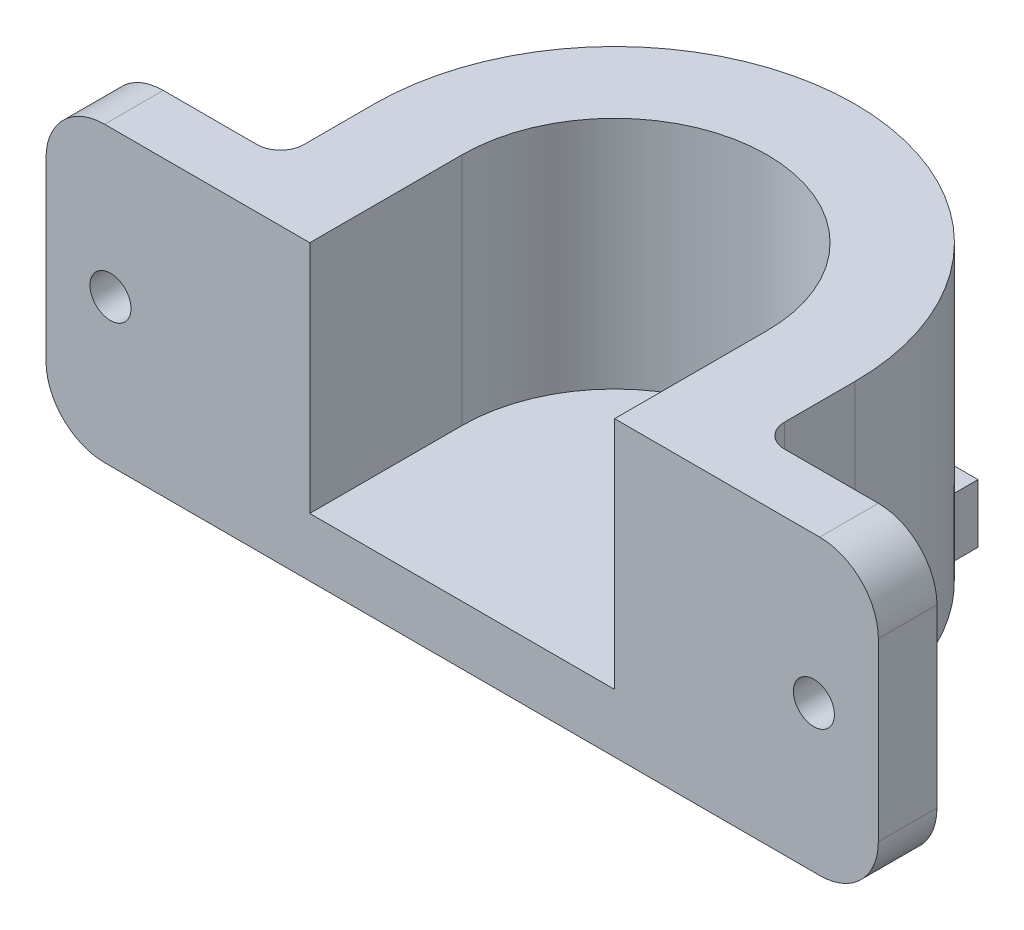
ISO-10303-21;
HEADER;
FILE_DESCRIPTION(('STEP AP214'),'2;1');
FILE_NAME('part.step','',(''),(''),'','','');
FILE_SCHEMA(('AUTOMOTIVE_DESIGN { 1 0 10303 214 1 1 1 1 }'));
ENDSEC;
DATA;
#1=APPLICATION_CONTEXT('core data for automotive mechanical design processes');
#2=APPLICATION_PROTOCOL_DEFINITION('international standard','automotive_design',2000,#1);
#3=PRODUCT_CONTEXT('',#1,'mechanical');
#4=PRODUCT('Part','Part','',(#3));
#5=PRODUCT_RELATED_PRODUCT_CATEGORY('part','',(#4));
#6=PRODUCT_DEFINITION_FORMATION('','',#4);
#7=PRODUCT_DEFINITION_CONTEXT('part definition',#1,'design');
#8=PRODUCT_DEFINITION('design','',#6,#7);
#9=PRODUCT_DEFINITION_SHAPE('','',#8);
#10=(LENGTH_UNIT() NAMED_UNIT(*) SI_UNIT(.MILLI.,.METRE.));
#11=(NAMED_UNIT(*) PLANE_ANGLE_UNIT() SI_UNIT($,.RADIAN.));
#12=(NAMED_UNIT(*) SI_UNIT($,.STERADIAN.) SOLID_ANGLE_UNIT());
#13=UNCERTAINTY_MEASURE_WITH_UNIT(LENGTH_MEASURE(1.E-05),#10,'distance_accuracy_value','');
#14=(GEOMETRIC_REPRESENTATION_CONTEXT(3) GLOBAL_UNCERTAINTY_ASSIGNED_CONTEXT((#13)) GLOBAL_UNIT_ASSIGNED_CONTEXT((#10,
#11,#12)) REPRESENTATION_CONTEXT('',''));
#15=CARTESIAN_POINT('',(0.,0.,0.));
#16=DIRECTION('',(0.,0.,1.));
#17=DIRECTION('',(1.,0.,0.));
#18=AXIS2_PLACEMENT_3D('',#15,#16,#17);
#19=CARTESIAN_POINT('',(0.,25.,13.));
#20=DIRECTION('',(-1.,0.,0.));
#21=DIRECTION('',(0.,0.,1.));
#22=AXIS2_PLACEMENT_3D('',#19,#20,#21);
#23=PLANE('',#22);
#24=DIRECTION('',(0.,-1.,0.));
#25=VECTOR('',#24,1.);
#26=CARTESIAN_POINT('',(0.,25.,13.));
#27=LINE('',#26,#25);
#28=CARTESIAN_POINT('',(0.,25.,13.));
#29=VERTEX_POINT('',#28);
#30=CARTESIAN_POINT('',(0.,5.,13.));
#31=VERTEX_POINT('',#30);
#32=EDGE_CURVE('E294',#29,#31,#27,.T.);
#33=ORIENTED_EDGE('',*,*,#32,.T.);
#34=DIRECTION('',(0.,0.,1.));
#35=VECTOR('',#34,1.);
#36=CARTESIAN_POINT('',(0.,5.,-18.));
#37=LINE('',#36,#35);
#38=CARTESIAN_POINT('',(0.,5.,0.));
#39=VERTEX_POINT('',#38);
#40=EDGE_CURVE('E54',#39,#31,#37,.T.);
#41=ORIENTED_EDGE('',*,*,#40,.F.);
#42=DIRECTION('',(0.,-1.,0.));
#43=VECTOR('',#42,1.);
#44=CARTESIAN_POINT('',(0.,25.,0.));
#45=LINE('',#44,#43);
#46=CARTESIAN_POINT('',(0.,25.,0.));
#47=VERTEX_POINT('',#46);
#48=EDGE_CURVE('E334',#47,#39,#45,.T.);
#49=ORIENTED_EDGE('',*,*,#48,.F.);
#50=DIRECTION('',(0.,0.,-1.));
#51=VECTOR('',#50,1.);
#52=CARTESIAN_POINT('',(0.,25.,13.));
#53=LINE('',#52,#51);
#54=EDGE_CURVE('E269',#29,#47,#53,.T.);
#55=ORIENTED_EDGE('',*,*,#54,.F.);
#56=EDGE_LOOP('',(#33,#41,#49,#55));
#57=FACE_BOUND('',#56,.T.);
#58=ADVANCED_FACE('F39',(#57),#23,.F.);
#59=CARTESIAN_POINT('',(13.,25.,0.));
#60=DIRECTION('',(0.,-1.,0.));
#61=DIRECTION('',(0.,0.,-1.));
#62=AXIS2_PLACEMENT_3D('',#59,#60,#61);
#63=CYLINDRICAL_SURFACE('',#62,13.);
#64=ORIENTED_EDGE('',*,*,#48,.T.);
#65=CARTESIAN_POINT('',(13.,5.,0.));
#66=DIRECTION('',(0.,1.,0.));
#67=DIRECTION('',(-1.,0.,0.));
#68=AXIS2_PLACEMENT_3D('',#65,#66,#67);
#69=CIRCLE('',#68,13.);
#70=CARTESIAN_POINT('',(26.,5.,0.));
#71=VERTEX_POINT('',#70);
#72=EDGE_CURVE('E61',#39,#71,#69,.F.);
#73=ORIENTED_EDGE('',*,*,#72,.T.);
#74=DIRECTION('',(0.,-1.,0.));
#75=VECTOR('',#74,1.);
#76=CARTESIAN_POINT('',(26.,25.,0.));
#77=LINE('',#76,#75);
#78=CARTESIAN_POINT('',(26.,25.,0.));
#79=VERTEX_POINT('',#78);
#80=EDGE_CURVE('E332',#79,#71,#77,.T.);
#81=ORIENTED_EDGE('',*,*,#80,.F.);
#82=CARTESIAN_POINT('',(13.,25.,0.));
#83=DIRECTION('',(0.,-1.,0.));
#84=DIRECTION('',(0.,0.,-1.));
#85=AXIS2_PLACEMENT_3D('',#82,#83,#84);
#86=CIRCLE('',#85,13.);
#87=EDGE_CURVE('E272',#47,#79,#86,.T.);
#88=ORIENTED_EDGE('',*,*,#87,.F.);
#89=EDGE_LOOP('',(#64,#73,#81,#88));
#90=FACE_BOUND('',#89,.T.);
#91=ADVANCED_FACE('F418',(#90),#63,.F.);
#92=CARTESIAN_POINT('',(26.,25.,0.));
#93=DIRECTION('',(1.,0.,0.));
#94=DIRECTION('',(0.,0.,-1.));
#95=AXIS2_PLACEMENT_3D('',#92,#93,#94);
#96=PLANE('',#95);
#97=ORIENTED_EDGE('',*,*,#80,.T.);
#98=DIRECTION('',(0.,0.,1.));
#99=VECTOR('',#98,1.);
#100=CARTESIAN_POINT('',(26.,5.,-18.));
#101=LINE('',#100,#99);
#102=CARTESIAN_POINT('',(26.,5.,13.));
#103=VERTEX_POINT('',#102);
#104=EDGE_CURVE('E243',#71,#103,#101,.T.);
#105=ORIENTED_EDGE('',*,*,#104,.T.);
#106=DIRECTION('',(0.,-1.,0.));
#107=VECTOR('',#106,1.);
#108=CARTESIAN_POINT('',(26.,25.,13.));
#109=LINE('',#108,#107);
#110=CARTESIAN_POINT('',(26.,25.,13.));
#111=VERTEX_POINT('',#110);
#112=EDGE_CURVE('E329',#111,#103,#109,.T.);
#113=ORIENTED_EDGE('',*,*,#112,.F.);
#114=DIRECTION('',(0.,0.,1.));
#115=VECTOR('',#114,1.);
#116=CARTESIAN_POINT('',(26.,25.,0.));
#117=LINE('',#116,#115);
#118=EDGE_CURVE('E275',#79,#111,#117,.T.);
#119=ORIENTED_EDGE('',*,*,#118,.F.);
#120=EDGE_LOOP('',(#97,#105,#113,#119));
#121=FACE_BOUND('',#120,.T.);
#122=ADVANCED_FACE('F424',(#121),#96,.F.);
#123=CARTESIAN_POINT('',(48.5,25.,13.));
#124=DIRECTION('',(-1.,0.,0.));
#125=DIRECTION('',(0.,0.,1.));
#126=AXIS2_PLACEMENT_3D('',#123,#124,#125);
#127=PLANE('',#126);
#128=DIRECTION('',(0.,-1.,0.));
#129=VECTOR('',#128,1.);
#130=CARTESIAN_POINT('',(48.5,25.,7.99999999999999));
#131=LINE('',#130,#129);
#132=CARTESIAN_POINT('',(48.5,20.,7.99999999999999));
#133=VERTEX_POINT('',#132);
#134=CARTESIAN_POINT('',(48.5,5.,7.99999999999999));
#135=VERTEX_POINT('',#134);
#136=EDGE_CURVE('E323',#133,#135,#131,.T.);
#137=ORIENTED_EDGE('',*,*,#136,.F.);
#138=DIRECTION('',(0.,0.,-1.));
#139=VECTOR('',#138,1.);
#140=CARTESIAN_POINT('',(48.5,20.,13.));
#141=LINE('',#140,#139);
#142=CARTESIAN_POINT('',(48.5,20.,13.));
#143=VERTEX_POINT('',#142);
#144=EDGE_CURVE('E349',#133,#143,#141,.F.);
#145=ORIENTED_EDGE('',*,*,#144,.T.);
#146=DIRECTION('',(0.,-1.,0.));
#147=VECTOR('',#146,1.);
#148=CARTESIAN_POINT('',(48.5,25.,13.));
#149=LINE('',#148,#147);
#150=CARTESIAN_POINT('',(48.5,5.,13.));
#151=VERTEX_POINT('',#150);
#152=EDGE_CURVE('E326',#143,#151,#149,.T.);
#153=ORIENTED_EDGE('',*,*,#152,.T.);
#154=DIRECTION('',(0.,0.,-1.));
#155=VECTOR('',#154,1.);
#156=CARTESIAN_POINT('',(48.5,5.,7.99999999999999));
#157=LINE('',#156,#155);
#158=EDGE_CURVE('E346',#151,#135,#157,.T.);
#159=ORIENTED_EDGE('',*,*,#158,.T.);
#160=EDGE_LOOP('',(#137,#145,#153,#159));
#161=FACE_BOUND('',#160,.T.);
#162=ADVANCED_FACE('F501',(#161),#127,.F.);
#163=CARTESIAN_POINT('',(48.5,25.,7.99999999999999));
#164=DIRECTION('',(0.,0.,1.));
#165=DIRECTION('',(1.,0.,0.));
#166=AXIS2_PLACEMENT_3D('',#163,#164,#165);
#167=PLANE('',#166);
#168=CARTESIAN_POINT('',(43.,12.5,7.99999999999999));
#169=DIRECTION('',(0.,0.,-1.));
#170=DIRECTION('',(-1.,0.,0.));
#171=AXIS2_PLACEMENT_3D('',#168,#169,#170);
#172=CIRCLE('',#171,1.75);
#173=CARTESIAN_POINT('',(41.25,12.5,7.99999999999999));
#174=VERTEX_POINT('',#173);
#175=EDGE_CURVE('E261',#174,#174,#172,.T.);
#176=ORIENTED_EDGE('',*,*,#175,.F.);
#177=EDGE_LOOP('',(#176));
#178=FACE_BOUND('',#177,.T.);
#179=DIRECTION('',(-1.,0.,0.));
#180=VECTOR('',#179,1.);
#181=CARTESIAN_POINT('',(48.5,0.,7.99999999999999));
#182=LINE('',#181,#180);
#183=CARTESIAN_POINT('',(43.5,0.,7.99999999999999));
#184=VERTEX_POINT('',#183);
#185=CARTESIAN_POINT('',(35.5,0.,7.99999999999999));
#186=VERTEX_POINT('',#185);
#187=EDGE_CURVE('E297',#184,#186,#182,.T.);
#188=ORIENTED_EDGE('',*,*,#187,.T.);
#189=DIRECTION('',(0.,-1.,0.));
#190=VECTOR('',#189,1.);
#191=CARTESIAN_POINT('',(35.5,25.,7.99999999999999));
#192=LINE('',#191,#190);
#193=CARTESIAN_POINT('',(35.5,25.,7.99999999999999));
#194=VERTEX_POINT('',#193);
#195=EDGE_CURVE('E378',#186,#194,#192,.F.);
#196=ORIENTED_EDGE('',*,*,#195,.T.);
#197=DIRECTION('',(-1.,0.,0.));
#198=VECTOR('',#197,1.);
#199=CARTESIAN_POINT('',(48.5,25.,7.99999999999999));
#200=LINE('',#199,#198);
#201=CARTESIAN_POINT('',(43.5,25.,7.99999999999999));
#202=VERTEX_POINT('',#201);
#203=EDGE_CURVE('E280',#202,#194,#200,.T.);
#204=ORIENTED_EDGE('',*,*,#203,.F.);
#205=CARTESIAN_POINT('',(43.5,20.,7.99999999999999));
#206=DIRECTION('',(0.,0.,1.));
#207=DIRECTION('',(1.,0.,0.));
#208=AXIS2_PLACEMENT_3D('',#205,#206,#207);
#209=CIRCLE('',#208,5.);
#210=EDGE_CURVE('E344',#202,#133,#209,.F.);
#211=ORIENTED_EDGE('',*,*,#210,.T.);
#212=ORIENTED_EDGE('',*,*,#136,.T.);
#213=CARTESIAN_POINT('',(43.5,5.,7.99999999999999));
#214=DIRECTION('',(0.,0.,1.));
#215=DIRECTION('',(1.,0.,0.));
#216=AXIS2_PLACEMENT_3D('',#213,#214,#215);
#217=CIRCLE('',#216,5.);
#218=EDGE_CURVE('E342',#135,#184,#217,.F.);
#219=ORIENTED_EDGE('',*,*,#218,.T.);
#220=EDGE_LOOP('',(#188,#196,#204,#211,#212,#219));
#221=FACE_BOUND('',#220,.T.);
#222=ADVANCED_FACE('F499',(#178,#221),#167,.F.);
#223=CARTESIAN_POINT('',(33.5,25.,7.99999999999999));
#224=DIRECTION('',(-1.,0.,0.));
#225=DIRECTION('',(0.,0.,1.));
#226=AXIS2_PLACEMENT_3D('',#223,#224,#225);
#227=PLANE('',#226);
#228=DIRECTION('',(0.,0.,-1.));
#229=VECTOR('',#228,1.);
#230=CARTESIAN_POINT('',(33.5,25.,7.99999999999999));
#231=LINE('',#230,#229);
#232=CARTESIAN_POINT('',(33.5,25.,5.99999999999999));
#233=VERTEX_POINT('',#232);
#234=CARTESIAN_POINT('',(33.5,25.,0.));
#235=VERTEX_POINT('',#234);
#236=EDGE_CURVE('E283',#233,#235,#231,.T.);
#237=ORIENTED_EDGE('',*,*,#236,.F.);
#238=DIRECTION('',(0.,-1.,0.));
#239=VECTOR('',#238,1.);
#240=CARTESIAN_POINT('',(33.5,0.,5.99999999999999));
#241=LINE('',#240,#239);
#242=CARTESIAN_POINT('',(33.5,0.,5.99999999999999));
#243=VERTEX_POINT('',#242);
#244=EDGE_CURVE('E375',#233,#243,#241,.T.);
#245=ORIENTED_EDGE('',*,*,#244,.T.);
#246=DIRECTION('',(0.,0.,-1.));
#247=VECTOR('',#246,1.);
#248=CARTESIAN_POINT('',(33.5,0.,7.99999999999999));
#249=LINE('',#248,#247);
#250=CARTESIAN_POINT('',(33.5,0.,0.));
#251=VERTEX_POINT('',#250);
#252=EDGE_CURVE('E300',#243,#251,#249,.T.);
#253=ORIENTED_EDGE('',*,*,#252,.T.);
#254=DIRECTION('',(0.,-1.,0.));
#255=VECTOR('',#254,1.);
#256=CARTESIAN_POINT('',(33.5,25.,0.));
#257=LINE('',#256,#255);
#258=EDGE_CURVE('E320',#235,#251,#257,.T.);
#259=ORIENTED_EDGE('',*,*,#258,.F.);
#260=EDGE_LOOP('',(#237,#245,#253,#259));
#261=FACE_BOUND('',#260,.T.);
#262=ADVANCED_FACE('F459',(#261),#227,.F.);
#263=CARTESIAN_POINT('',(13.,25.,0.));
#264=DIRECTION('',(0.,-1.,0.));
#265=DIRECTION('',(0.,0.,-1.));
#266=AXIS2_PLACEMENT_3D('',#263,#264,#265);
#267=CYLINDRICAL_SURFACE('',#266,20.5);
#268=CARTESIAN_POINT('',(13.,0.,0.));
#269=DIRECTION('',(0.,1.,0.));
#270=DIRECTION('',(0.,0.,-1.));
#271=AXIS2_PLACEMENT_3D('',#268,#269,#270);
#272=CIRCLE('',#271,20.5);
#273=CARTESIAN_POINT('',(26.,0.,-15.8508674841474));
#274=VERTEX_POINT('',#273);
#275=EDGE_CURVE('E302',#251,#274,#272,.T.);
#276=ORIENTED_EDGE('',*,*,#275,.T.);
#277=DIRECTION('',(0.,-1.,0.));
#278=VECTOR('',#277,1.);
#279=CARTESIAN_POINT('',(26.,25.,-15.8508674841474));
#280=LINE('',#279,#278);
#281=CARTESIAN_POINT('',(26.,5.,-15.8508674841474));
#282=VERTEX_POINT('',#281);
#283=EDGE_CURVE('E250',#274,#282,#280,.F.);
#284=ORIENTED_EDGE('',*,*,#283,.T.);
#285=CARTESIAN_POINT('',(13.,5.,0.));
#286=DIRECTION('',(0.,1.,0.));
#287=DIRECTION('',(-1.,0.,0.));
#288=AXIS2_PLACEMENT_3D('',#285,#286,#287);
#289=CIRCLE('',#288,20.5);
#290=CARTESIAN_POINT('',(22.8107084351743,5.,-18.));
#291=VERTEX_POINT('',#290);
#292=EDGE_CURVE('E11',#282,#291,#289,.T.);
#293=ORIENTED_EDGE('',*,*,#292,.T.);
#294=DIRECTION('',(0.,-1.,0.));
#295=VECTOR('',#294,1.);
#296=CARTESIAN_POINT('',(22.8107084351743,25.,-18.));
#297=LINE('',#296,#295);
#298=CARTESIAN_POINT('',(22.8107084351743,0.,-18.));
#299=VERTEX_POINT('',#298);
#300=EDGE_CURVE('E247',#291,#299,#297,.T.);
#301=ORIENTED_EDGE('',*,*,#300,.T.);
#302=CARTESIAN_POINT('',(3.18929156482572,0.,-18.));
#303=VERTEX_POINT('',#302);
#304=EDGE_CURVE('E306',#299,#303,#272,.T.);
#305=ORIENTED_EDGE('',*,*,#304,.T.);
#306=DIRECTION('',(0.,-1.,0.));
#307=VECTOR('',#306,1.);
#308=CARTESIAN_POINT('',(3.18929156482572,25.,-18.));
#309=LINE('',#308,#307);
#310=CARTESIAN_POINT('',(3.18929156482572,5.,-18.));
#311=VERTEX_POINT('',#310);
#312=EDGE_CURVE('E221',#303,#311,#309,.F.);
#313=ORIENTED_EDGE('',*,*,#312,.T.);
#314=CARTESIAN_POINT('',(0.,5.,-15.8508674841474));
#315=VERTEX_POINT('',#314);
#316=EDGE_CURVE('E43',#311,#315,#289,.T.);
#317=ORIENTED_EDGE('',*,*,#316,.T.);
#318=DIRECTION('',(0.,-1.,0.));
#319=VECTOR('',#318,1.);
#320=CARTESIAN_POINT('',(0.,25.,-15.8508674841474));
#321=LINE('',#320,#319);
#322=CARTESIAN_POINT('',(0.,0.,-15.8508674841474));
#323=VERTEX_POINT('',#322);
#324=EDGE_CURVE('E253',#315,#323,#321,.T.);
#325=ORIENTED_EDGE('',*,*,#324,.T.);
#326=CARTESIAN_POINT('',(-7.5,0.,0.));
#327=VERTEX_POINT('',#326);
#328=EDGE_CURVE('E209',#323,#327,#272,.T.);
#329=ORIENTED_EDGE('',*,*,#328,.T.);
#330=DIRECTION('',(0.,-1.,0.));
#331=VECTOR('',#330,1.);
#332=CARTESIAN_POINT('',(-7.5,25.,0.));
#333=LINE('',#332,#331);
#334=CARTESIAN_POINT('',(-7.5,25.,0.));
#335=VERTEX_POINT('',#334);
#336=EDGE_CURVE('E317',#335,#327,#333,.T.);
#337=ORIENTED_EDGE('',*,*,#336,.F.);
#338=CARTESIAN_POINT('',(13.,25.,0.));
#339=DIRECTION('',(0.,1.,0.));
#340=DIRECTION('',(0.,0.,-1.));
#341=AXIS2_PLACEMENT_3D('',#338,#339,#340);
#342=CIRCLE('',#341,20.5);
#343=EDGE_CURVE('E285',#235,#335,#342,.T.);
#344=ORIENTED_EDGE('',*,*,#343,.F.);
#345=ORIENTED_EDGE('',*,*,#258,.T.);
#346=EDGE_LOOP('',(#276,#284,#293,#301,#305,#313,#317,#325,#329,#337,#344,#345));
#347=FACE_BOUND('',#346,.T.);
#348=ADVANCED_FACE('F397',(#347),#267,.T.);
#349=CARTESIAN_POINT('',(-7.5,25.,0.));
#350=DIRECTION('',(1.,0.,0.));
#351=DIRECTION('',(0.,0.,-1.));
#352=AXIS2_PLACEMENT_3D('',#349,#350,#351);
#353=PLANE('',#352);
#354=DIRECTION('',(0.,0.,1.));
#355=VECTOR('',#354,1.);
#356=CARTESIAN_POINT('',(-7.5,0.,0.));
#357=LINE('',#356,#355);
#358=CARTESIAN_POINT('',(-7.5,0.,6.));
#359=VERTEX_POINT('',#358);
#360=EDGE_CURVE('E305',#327,#359,#357,.T.);
#361=ORIENTED_EDGE('',*,*,#360,.T.);
#362=DIRECTION('',(0.,-1.,0.));
#363=VECTOR('',#362,1.);
#364=CARTESIAN_POINT('',(-7.5,25.,6.));
#365=LINE('',#364,#363);
#366=CARTESIAN_POINT('',(-7.5,25.,6.));
#367=VERTEX_POINT('',#366);
#368=EDGE_CURVE('E383',#359,#367,#365,.F.);
#369=ORIENTED_EDGE('',*,*,#368,.T.);
#370=DIRECTION('',(0.,0.,1.));
#371=VECTOR('',#370,1.);
#372=CARTESIAN_POINT('',(-7.5,25.,0.));
#373=LINE('',#372,#371);
#374=EDGE_CURVE('E287',#335,#367,#373,.T.);
#375=ORIENTED_EDGE('',*,*,#374,.F.);
#376=ORIENTED_EDGE('',*,*,#336,.T.);
#377=EDGE_LOOP('',(#361,#369,#375,#376));
#378=FACE_BOUND('',#377,.T.);
#379=ADVANCED_FACE('F511',(#378),#353,.F.);
#380=CARTESIAN_POINT('',(-7.5,25.,8.));
#381=DIRECTION('',(0.,0.,1.));
#382=DIRECTION('',(1.,0.,0.));
#383=AXIS2_PLACEMENT_3D('',#380,#381,#382);
#384=PLANE('',#383);
#385=CARTESIAN_POINT('',(-17.,12.5,8.));
#386=DIRECTION('',(0.,0.,-1.));
#387=DIRECTION('',(1.,0.,0.));
#388=AXIS2_PLACEMENT_3D('',#385,#386,#387);
#389=CIRCLE('',#388,1.75);
#390=CARTESIAN_POINT('',(-15.25,12.5,8.));
#391=VERTEX_POINT('',#390);
#392=EDGE_CURVE('E264',#391,#391,#389,.T.);
#393=ORIENTED_EDGE('',*,*,#392,.F.);
#394=EDGE_LOOP('',(#393));
#395=FACE_BOUND('',#394,.T.);
#396=DIRECTION('',(-1.,0.,0.));
#397=VECTOR('',#396,1.);
#398=CARTESIAN_POINT('',(-7.5,25.,8.));
#399=LINE('',#398,#397);
#400=CARTESIAN_POINT('',(-9.5,25.,8.));
#401=VERTEX_POINT('',#400);
#402=CARTESIAN_POINT('',(-17.5,25.,8.));
#403=VERTEX_POINT('',#402);
#404=EDGE_CURVE('E290',#401,#403,#399,.T.);
#405=ORIENTED_EDGE('',*,*,#404,.F.);
#406=DIRECTION('',(0.,-1.,0.));
#407=VECTOR('',#406,1.);
#408=CARTESIAN_POINT('',(-9.5,0.,8.));
#409=LINE('',#408,#407);
#410=CARTESIAN_POINT('',(-9.5,0.,8.));
#411=VERTEX_POINT('',#410);
#412=EDGE_CURVE('E380',#401,#411,#409,.T.);
#413=ORIENTED_EDGE('',*,*,#412,.T.);
#414=DIRECTION('',(-1.,0.,0.));
#415=VECTOR('',#414,1.);
#416=CARTESIAN_POINT('',(-7.5,0.,8.));
#417=LINE('',#416,#415);
#418=CARTESIAN_POINT('',(-17.5,0.,8.));
#419=VERTEX_POINT('',#418);
#420=EDGE_CURVE('E273',#411,#419,#417,.T.);
#421=ORIENTED_EDGE('',*,*,#420,.T.);
#422=CARTESIAN_POINT('',(-17.5,5.,8.));
#423=DIRECTION('',(0.,0.,1.));
#424=DIRECTION('',(1.,0.,0.));
#425=AXIS2_PLACEMENT_3D('',#422,#423,#424);
#426=CIRCLE('',#425,5.);
#427=CARTESIAN_POINT('',(-22.5,5.,8.));
#428=VERTEX_POINT('',#427);
#429=EDGE_CURVE('E370',#419,#428,#426,.F.);
#430=ORIENTED_EDGE('',*,*,#429,.T.);
#431=DIRECTION('',(0.,-1.,0.));
#432=VECTOR('',#431,1.);
#433=CARTESIAN_POINT('',(-22.5,25.,8.));
#434=LINE('',#433,#432);
#435=CARTESIAN_POINT('',(-22.5,20.,8.));
#436=VERTEX_POINT('',#435);
#437=EDGE_CURVE('E314',#436,#428,#434,.T.);
#438=ORIENTED_EDGE('',*,*,#437,.F.);
#439=CARTESIAN_POINT('',(-17.5,20.,8.));
#440=DIRECTION('',(0.,0.,1.));
#441=DIRECTION('',(1.,0.,0.));
#442=AXIS2_PLACEMENT_3D('',#439,#440,#441);
#443=CIRCLE('',#442,5.);
#444=EDGE_CURVE('E372',#436,#403,#443,.F.);
#445=ORIENTED_EDGE('',*,*,#444,.T.);
#446=EDGE_LOOP('',(#405,#413,#421,#430,#438,#445));
#447=FACE_BOUND('',#446,.T.);
#448=ADVANCED_FACE('F470',(#395,#447),#384,.F.);
#449=CARTESIAN_POINT('',(-22.5,25.,8.));
#450=DIRECTION('',(1.,0.,0.));
#451=DIRECTION('',(0.,0.,-1.));
#452=AXIS2_PLACEMENT_3D('',#449,#450,#451);
#453=PLANE('',#452);
#454=DIRECTION('',(0.,-1.,0.));
#455=VECTOR('',#454,1.);
#456=CARTESIAN_POINT('',(-22.5,25.,13.));
#457=LINE('',#456,#455);
#458=CARTESIAN_POINT('',(-22.5,20.,13.));
#459=VERTEX_POINT('',#458);
#460=CARTESIAN_POINT('',(-22.5,5.,13.));
#461=VERTEX_POINT('',#460);
#462=EDGE_CURVE('E311',#459,#461,#457,.T.);
#463=ORIENTED_EDGE('',*,*,#462,.F.);
#464=DIRECTION('',(0.,0.,1.));
#465=VECTOR('',#464,1.);
#466=CARTESIAN_POINT('',(-22.5,20.,8.));
#467=LINE('',#466,#465);
#468=EDGE_CURVE('E368',#459,#436,#467,.F.);
#469=ORIENTED_EDGE('',*,*,#468,.T.);
#470=ORIENTED_EDGE('',*,*,#437,.T.);
#471=DIRECTION('',(0.,0.,1.));
#472=VECTOR('',#471,1.);
#473=CARTESIAN_POINT('',(-22.5,5.,13.));
#474=LINE('',#473,#472);
#475=EDGE_CURVE('E365',#428,#461,#474,.T.);
#476=ORIENTED_EDGE('',*,*,#475,.T.);
#477=EDGE_LOOP('',(#463,#469,#470,#476));
#478=FACE_BOUND('',#477,.T.);
#479=ADVANCED_FACE('F478',(#478),#453,.F.);
#480=CARTESIAN_POINT('',(-22.5,25.,13.));
#481=DIRECTION('',(0.,0.,-1.));
#482=DIRECTION('',(-1.,0.,0.));
#483=AXIS2_PLACEMENT_3D('',#480,#481,#482);
#484=PLANE('',#483);
#485=CARTESIAN_POINT('',(-17.,12.5,13.));
#486=DIRECTION('',(0.,0.,-1.));
#487=DIRECTION('',(1.,0.,0.));
#488=AXIS2_PLACEMENT_3D('',#485,#486,#487);
#489=CIRCLE('',#488,1.75);
#490=CARTESIAN_POINT('',(-15.25,12.5,13.));
#491=VERTEX_POINT('',#490);
#492=EDGE_CURVE('E256',#491,#491,#489,.T.);
#493=ORIENTED_EDGE('',*,*,#492,.T.);
#494=EDGE_LOOP('',(#493));
#495=FACE_BOUND('',#494,.T.);
#496=DIRECTION('',(1.,0.,0.));
#497=VECTOR('',#496,1.);
#498=CARTESIAN_POINT('',(-22.5,25.,13.));
#499=LINE('',#498,#497);
#500=CARTESIAN_POINT('',(-17.5,25.,13.));
#501=VERTEX_POINT('',#500);
#502=EDGE_CURVE('E292',#501,#29,#499,.T.);
#503=ORIENTED_EDGE('',*,*,#502,.F.);
#504=CARTESIAN_POINT('',(-17.5,20.,13.));
#505=DIRECTION('',(0.,0.,-1.));
#506=DIRECTION('',(-1.,0.,0.));
#507=AXIS2_PLACEMENT_3D('',#504,#505,#506);
#508=CIRCLE('',#507,5.);
#509=EDGE_CURVE('E363',#501,#459,#508,.F.);
#510=ORIENTED_EDGE('',*,*,#509,.T.);
#511=ORIENTED_EDGE('',*,*,#462,.T.);
#512=CARTESIAN_POINT('',(-17.5,5.,13.));
#513=DIRECTION('',(0.,0.,-1.));
#514=DIRECTION('',(-1.,0.,0.));
#515=AXIS2_PLACEMENT_3D('',#512,#513,#514);
#516=CIRCLE('',#515,5.);
#517=CARTESIAN_POINT('',(-17.5,0.,13.));
#518=VERTEX_POINT('',#517);
#519=EDGE_CURVE('E360',#461,#518,#516,.F.);
#520=ORIENTED_EDGE('',*,*,#519,.T.);
#521=DIRECTION('',(1.,0.,0.));
#522=VECTOR('',#521,1.);
#523=CARTESIAN_POINT('',(26.,0.,13.));
#524=LINE('',#523,#522);
#525=CARTESIAN_POINT('',(43.5,0.,13.));
#526=VERTEX_POINT('',#525);
#527=EDGE_CURVE('E260',#518,#526,#524,.T.);
#528=ORIENTED_EDGE('',*,*,#527,.T.);
#529=CARTESIAN_POINT('',(43.5,5.,13.));
#530=DIRECTION('',(0.,0.,-1.));
#531=DIRECTION('',(-1.,0.,0.));
#532=AXIS2_PLACEMENT_3D('',#529,#530,#531);
#533=CIRCLE('',#532,5.);
#534=EDGE_CURVE('E351',#526,#151,#533,.F.);
#535=ORIENTED_EDGE('',*,*,#534,.T.);
#536=ORIENTED_EDGE('',*,*,#152,.F.);
#537=CARTESIAN_POINT('',(43.5,20.,13.));
#538=DIRECTION('',(0.,0.,-1.));
#539=DIRECTION('',(-1.,0.,0.));
#540=AXIS2_PLACEMENT_3D('',#537,#538,#539);
#541=CIRCLE('',#540,5.);
#542=CARTESIAN_POINT('',(43.5,25.,13.));
#543=VERTEX_POINT('',#542);
#544=EDGE_CURVE('E353',#143,#543,#541,.F.);
#545=ORIENTED_EDGE('',*,*,#544,.T.);
#546=DIRECTION('',(1.,0.,0.));
#547=VECTOR('',#546,1.);
#548=CARTESIAN_POINT('',(26.,25.,13.));
#549=LINE('',#548,#547);
#550=EDGE_CURVE('E277',#111,#543,#549,.T.);
#551=ORIENTED_EDGE('',*,*,#550,.F.);
#552=ORIENTED_EDGE('',*,*,#112,.T.);
#553=DIRECTION('',(-1.,0.,0.));
#554=VECTOR('',#553,1.);
#555=CARTESIAN_POINT('',(0.,5.,13.));
#556=LINE('',#555,#554);
#557=EDGE_CURVE('E229',#103,#31,#556,.T.);
#558=ORIENTED_EDGE('',*,*,#557,.T.);
#559=ORIENTED_EDGE('',*,*,#32,.F.);
#560=EDGE_LOOP('',(#503,#510,#511,#520,#528,#535,#536,#545,#551,#552,#558,#559));
#561=FACE_BOUND('',#560,.T.);
#562=CARTESIAN_POINT('',(43.,12.5,13.));
#563=DIRECTION('',(0.,0.,-1.));
#564=DIRECTION('',(-1.,0.,0.));
#565=AXIS2_PLACEMENT_3D('',#562,#563,#564);
#566=CIRCLE('',#565,1.75);
#567=CARTESIAN_POINT('',(41.25,12.5,13.));
#568=VERTEX_POINT('',#567);
#569=EDGE_CURVE('E257',#568,#568,#566,.T.);
#570=ORIENTED_EDGE('',*,*,#569,.T.);
#571=EDGE_LOOP('',(#570));
#572=FACE_BOUND('',#571,.T.);
#573=ADVANCED_FACE('F484',(#495,#561,#572),#484,.F.);
#574=CARTESIAN_POINT('',(13.,25.,0.));
#575=DIRECTION('',(0.,-1.,0.));
#576=DIRECTION('',(0.,0.,-1.));
#577=AXIS2_PLACEMENT_3D('',#574,#575,#576);
#578=PLANE('',#577);
#579=ORIENTED_EDGE('',*,*,#550,.T.);
#580=DIRECTION('',(0.,0.,-1.));
#581=VECTOR('',#580,1.);
#582=CARTESIAN_POINT('',(43.5,25.,0.));
#583=LINE('',#582,#581);
#584=EDGE_CURVE('E339',#543,#202,#583,.T.);
#585=ORIENTED_EDGE('',*,*,#584,.T.);
#586=ORIENTED_EDGE('',*,*,#203,.T.);
#587=CARTESIAN_POINT('',(35.5,25.,5.99999999999999));
#588=DIRECTION('',(0.,-1.,0.));
#589=DIRECTION('',(0.,0.,-1.));
#590=AXIS2_PLACEMENT_3D('',#587,#588,#589);
#591=CIRCLE('',#590,2.);
#592=EDGE_CURVE('E387',#194,#233,#591,.T.);
#593=ORIENTED_EDGE('',*,*,#592,.T.);
#594=ORIENTED_EDGE('',*,*,#236,.T.);
#595=ORIENTED_EDGE('',*,*,#343,.T.);
#596=ORIENTED_EDGE('',*,*,#374,.T.);
#597=CARTESIAN_POINT('',(-9.5,25.,6.));
#598=DIRECTION('',(0.,-1.,0.));
#599=DIRECTION('',(0.,0.,-1.));
#600=AXIS2_PLACEMENT_3D('',#597,#598,#599);
#601=CIRCLE('',#600,2.);
#602=EDGE_CURVE('E390',#367,#401,#601,.T.);
#603=ORIENTED_EDGE('',*,*,#602,.T.);
#604=ORIENTED_EDGE('',*,*,#404,.T.);
#605=DIRECTION('',(0.,0.,1.));
#606=VECTOR('',#605,1.);
#607=CARTESIAN_POINT('',(-17.5,25.,0.));
#608=LINE('',#607,#606);
#609=EDGE_CURVE('E336',#403,#501,#608,.T.);
#610=ORIENTED_EDGE('',*,*,#609,.T.);
#611=ORIENTED_EDGE('',*,*,#502,.T.);
#612=ORIENTED_EDGE('',*,*,#54,.T.);
#613=ORIENTED_EDGE('',*,*,#87,.T.);
#614=ORIENTED_EDGE('',*,*,#118,.T.);
#615=EDGE_LOOP('',(#579,#585,#586,#593,#594,#595,#596,#603,#604,#610,#611,#612,#613,#614));
#616=FACE_BOUND('',#615,.T.);
#617=ADVANCED_FACE('F455',(#616),#578,.F.);
#618=CARTESIAN_POINT('',(13.,0.,0.));
#619=DIRECTION('',(0.,-1.,0.));
#620=DIRECTION('',(0.,0.,-1.));
#621=AXIS2_PLACEMENT_3D('',#618,#619,#620);
#622=PLANE('',#621);
#623=ORIENTED_EDGE('',*,*,#304,.F.);
#624=DIRECTION('',(1.,0.,0.));
#625=VECTOR('',#624,1.);
#626=CARTESIAN_POINT('',(0.,0.,-18.));
#627=LINE('',#626,#625);
#628=CARTESIAN_POINT('',(26.,0.,-18.));
#629=VERTEX_POINT('',#628);
#630=EDGE_CURVE('E223',#299,#629,#627,.T.);
#631=ORIENTED_EDGE('',*,*,#630,.T.);
#632=DIRECTION('',(0.,0.,1.));
#633=VECTOR('',#632,1.);
#634=CARTESIAN_POINT('',(26.,0.,-18.));
#635=LINE('',#634,#633);
#636=EDGE_CURVE('E213',#629,#274,#635,.T.);
#637=ORIENTED_EDGE('',*,*,#636,.T.);
#638=ORIENTED_EDGE('',*,*,#275,.F.);
#639=ORIENTED_EDGE('',*,*,#252,.F.);
#640=CARTESIAN_POINT('',(35.5,0.,5.99999999999999));
#641=DIRECTION('',(0.,-1.,0.));
#642=DIRECTION('',(0.,0.,-1.));
#643=AXIS2_PLACEMENT_3D('',#640,#641,#642);
#644=CIRCLE('',#643,2.);
#645=EDGE_CURVE('E385',#243,#186,#644,.F.);
#646=ORIENTED_EDGE('',*,*,#645,.T.);
#647=ORIENTED_EDGE('',*,*,#187,.F.);
#648=DIRECTION('',(0.,0.,-1.));
#649=VECTOR('',#648,1.);
#650=CARTESIAN_POINT('',(43.5,0.,13.));
#651=LINE('',#650,#649);
#652=EDGE_CURVE('E358',#184,#526,#651,.F.);
#653=ORIENTED_EDGE('',*,*,#652,.T.);
#654=ORIENTED_EDGE('',*,*,#527,.F.);
#655=DIRECTION('',(0.,0.,1.));
#656=VECTOR('',#655,1.);
#657=CARTESIAN_POINT('',(-17.5,0.,8.));
#658=LINE('',#657,#656);
#659=EDGE_CURVE('E355',#518,#419,#658,.F.);
#660=ORIENTED_EDGE('',*,*,#659,.T.);
#661=ORIENTED_EDGE('',*,*,#420,.F.);
#662=CARTESIAN_POINT('',(-9.5,0.,6.));
#663=DIRECTION('',(0.,-1.,0.));
#664=DIRECTION('',(0.,0.,-1.));
#665=AXIS2_PLACEMENT_3D('',#662,#663,#664);
#666=CIRCLE('',#665,2.);
#667=EDGE_CURVE('E389',#411,#359,#666,.F.);
#668=ORIENTED_EDGE('',*,*,#667,.T.);
#669=ORIENTED_EDGE('',*,*,#360,.F.);
#670=ORIENTED_EDGE('',*,*,#328,.F.);
#671=DIRECTION('',(0.,0.,1.));
#672=VECTOR('',#671,1.);
#673=CARTESIAN_POINT('',(0.,0.,-18.));
#674=LINE('',#673,#672);
#675=CARTESIAN_POINT('',(0.,0.,-18.));
#676=VERTEX_POINT('',#675);
#677=EDGE_CURVE('E202',#676,#323,#674,.T.);
#678=ORIENTED_EDGE('',*,*,#677,.F.);
#679=EDGE_CURVE('E206',#676,#303,#627,.T.);
#680=ORIENTED_EDGE('',*,*,#679,.T.);
#681=EDGE_LOOP('',(#623,#631,#637,#638,#639,#646,#647,#653,#654,#660,#661,#668,#669,#670,#678,#680));
#682=FACE_BOUND('',#681,.T.);
#683=ADVANCED_FACE('F205',(#682),#622,.T.);
#684=CARTESIAN_POINT('',(-17.,12.5,13.));
#685=DIRECTION('',(0.,0.,-1.));
#686=DIRECTION('',(-1.,0.,0.));
#687=AXIS2_PLACEMENT_3D('',#684,#685,#686);
#688=CYLINDRICAL_SURFACE('',#687,1.75);
#689=ORIENTED_EDGE('',*,*,#492,.F.);
#690=EDGE_LOOP('',(#689));
#691=FACE_BOUND('',#690,.T.);
#692=ORIENTED_EDGE('',*,*,#392,.T.);
#693=EDGE_LOOP('',(#692));
#694=FACE_BOUND('',#693,.T.);
#695=ADVANCED_FACE('F555',(#691,#694),#688,.F.);
#696=CARTESIAN_POINT('',(43.,12.5,13.));
#697=DIRECTION('',(0.,0.,-1.));
#698=DIRECTION('',(-1.,0.,0.));
#699=AXIS2_PLACEMENT_3D('',#696,#697,#698);
#700=CYLINDRICAL_SURFACE('',#699,1.75);
#701=ORIENTED_EDGE('',*,*,#569,.F.);
#702=EDGE_LOOP('',(#701));
#703=FACE_BOUND('',#702,.T.);
#704=ORIENTED_EDGE('',*,*,#175,.T.);
#705=EDGE_LOOP('',(#704));
#706=FACE_BOUND('',#705,.T.);
#707=ADVANCED_FACE('F432',(#703,#706),#700,.F.);
#708=CARTESIAN_POINT('',(43.5,20.,0.));
#709=DIRECTION('',(0.,0.,-1.));
#710=DIRECTION('',(-1.,0.,0.));
#711=AXIS2_PLACEMENT_3D('',#708,#709,#710);
#712=CYLINDRICAL_SURFACE('',#711,5.);
#713=ORIENTED_EDGE('',*,*,#544,.F.);
#714=ORIENTED_EDGE('',*,*,#144,.F.);
#715=ORIENTED_EDGE('',*,*,#210,.F.);
#716=ORIENTED_EDGE('',*,*,#584,.F.);
#717=EDGE_LOOP('',(#713,#714,#715,#716));
#718=FACE_BOUND('',#717,.T.);
#719=ADVANCED_FACE('F428',(#718),#712,.T.);
#720=CARTESIAN_POINT('',(43.5,5.,13.));
#721=DIRECTION('',(0.,0.,1.));
#722=DIRECTION('',(1.,0.,0.));
#723=AXIS2_PLACEMENT_3D('',#720,#721,#722);
#724=CYLINDRICAL_SURFACE('',#723,5.);
#725=ORIENTED_EDGE('',*,*,#534,.F.);
#726=ORIENTED_EDGE('',*,*,#652,.F.);
#727=ORIENTED_EDGE('',*,*,#218,.F.);
#728=ORIENTED_EDGE('',*,*,#158,.F.);
#729=EDGE_LOOP('',(#725,#726,#727,#728));
#730=FACE_BOUND('',#729,.T.);
#731=ADVANCED_FACE('F431',(#730),#724,.T.);
#732=CARTESIAN_POINT('',(-17.5,20.,0.));
#733=DIRECTION('',(0.,0.,1.));
#734=DIRECTION('',(1.,0.,0.));
#735=AXIS2_PLACEMENT_3D('',#732,#733,#734);
#736=CYLINDRICAL_SURFACE('',#735,5.);
#737=ORIENTED_EDGE('',*,*,#444,.F.);
#738=ORIENTED_EDGE('',*,*,#468,.F.);
#739=ORIENTED_EDGE('',*,*,#509,.F.);
#740=ORIENTED_EDGE('',*,*,#609,.F.);
#741=EDGE_LOOP('',(#737,#738,#739,#740));
#742=FACE_BOUND('',#741,.T.);
#743=ADVANCED_FACE('F436',(#742),#736,.T.);
#744=CARTESIAN_POINT('',(-17.5,5.,8.));
#745=DIRECTION('',(0.,0.,-1.));
#746=DIRECTION('',(-1.,0.,0.));
#747=AXIS2_PLACEMENT_3D('',#744,#745,#746);
#748=CYLINDRICAL_SURFACE('',#747,5.);
#749=ORIENTED_EDGE('',*,*,#429,.F.);
#750=ORIENTED_EDGE('',*,*,#659,.F.);
#751=ORIENTED_EDGE('',*,*,#519,.F.);
#752=ORIENTED_EDGE('',*,*,#475,.F.);
#753=EDGE_LOOP('',(#749,#750,#751,#752));
#754=FACE_BOUND('',#753,.T.);
#755=ADVANCED_FACE('F440',(#754),#748,.T.);
#756=CARTESIAN_POINT('',(35.5,25.,5.99999999999999));
#757=DIRECTION('',(0.,1.,0.));
#758=DIRECTION('',(0.,0.,1.));
#759=AXIS2_PLACEMENT_3D('',#756,#757,#758);
#760=CYLINDRICAL_SURFACE('',#759,2.);
#761=ORIENTED_EDGE('',*,*,#592,.F.);
#762=ORIENTED_EDGE('',*,*,#195,.F.);
#763=ORIENTED_EDGE('',*,*,#645,.F.);
#764=ORIENTED_EDGE('',*,*,#244,.F.);
#765=EDGE_LOOP('',(#761,#762,#763,#764));
#766=FACE_BOUND('',#765,.T.);
#767=ADVANCED_FACE('F443',(#766),#760,.F.);
#768=CARTESIAN_POINT('',(-9.5,25.,6.));
#769=DIRECTION('',(0.,1.,0.));
#770=DIRECTION('',(0.,0.,1.));
#771=AXIS2_PLACEMENT_3D('',#768,#769,#770);
#772=CYLINDRICAL_SURFACE('',#771,2.);
#773=ORIENTED_EDGE('',*,*,#602,.F.);
#774=ORIENTED_EDGE('',*,*,#368,.F.);
#775=ORIENTED_EDGE('',*,*,#667,.F.);
#776=ORIENTED_EDGE('',*,*,#412,.F.);
#777=EDGE_LOOP('',(#773,#774,#775,#776));
#778=FACE_BOUND('',#777,.T.);
#779=ADVANCED_FACE('F41',(#778),#772,.F.);
#780=CARTESIAN_POINT('',(0.,5.,-18.));
#781=DIRECTION('',(0.,1.,0.));
#782=DIRECTION('',(-1.,0.,0.));
#783=AXIS2_PLACEMENT_3D('',#780,#781,#782);
#784=PLANE('',#783);
#785=ORIENTED_EDGE('',*,*,#72,.F.);
#786=ORIENTED_EDGE('',*,*,#40,.T.);
#787=ORIENTED_EDGE('',*,*,#557,.F.);
#788=ORIENTED_EDGE('',*,*,#104,.F.);
#789=EDGE_LOOP('',(#785,#786,#787,#788));
#790=FACE_BOUND('',#789,.T.);
#791=ADVANCED_FACE('F402',(#790),#784,.T.);
#792=CARTESIAN_POINT('',(0.,0.,-18.));
#793=DIRECTION('',(0.,0.,-1.));
#794=DIRECTION('',(-1.,0.,0.));
#795=AXIS2_PLACEMENT_3D('',#792,#793,#794);
#796=PLANE('',#795);
#797=ORIENTED_EDGE('',*,*,#312,.F.);
#798=ORIENTED_EDGE('',*,*,#679,.F.);
#799=DIRECTION('',(0.,-1.,0.));
#800=VECTOR('',#799,1.);
#801=CARTESIAN_POINT('',(0.,0.,-18.));
#802=LINE('',#801,#800);
#803=CARTESIAN_POINT('',(0.,5.,-18.));
#804=VERTEX_POINT('',#803);
#805=EDGE_CURVE('E219',#804,#676,#802,.T.);
#806=ORIENTED_EDGE('',*,*,#805,.F.);
#807=DIRECTION('',(-1.,0.,0.));
#808=VECTOR('',#807,1.);
#809=CARTESIAN_POINT('',(0.,5.,-18.));
#810=LINE('',#809,#808);
#811=EDGE_CURVE('E236',#311,#804,#810,.T.);
#812=ORIENTED_EDGE('',*,*,#811,.F.);
#813=EDGE_LOOP('',(#797,#798,#806,#812));
#814=FACE_BOUND('',#813,.T.);
#815=ADVANCED_FACE('F218',(#814),#796,.T.);
#816=ORIENTED_EDGE('',*,*,#316,.F.);
#817=ORIENTED_EDGE('',*,*,#811,.T.);
#818=EDGE_CURVE('E228',#804,#315,#37,.T.);
#819=ORIENTED_EDGE('',*,*,#818,.T.);
#820=EDGE_LOOP('',(#816,#817,#819));
#821=FACE_BOUND('',#820,.T.);
#822=ADVANCED_FACE('F399',(#821),#784,.T.);
#823=CARTESIAN_POINT('',(0.,0.,-18.));
#824=DIRECTION('',(-1.,0.,0.));
#825=DIRECTION('',(0.,0.,1.));
#826=AXIS2_PLACEMENT_3D('',#823,#824,#825);
#827=PLANE('',#826);
#828=ORIENTED_EDGE('',*,*,#324,.F.);
#829=ORIENTED_EDGE('',*,*,#818,.F.);
#830=ORIENTED_EDGE('',*,*,#805,.T.);
#831=ORIENTED_EDGE('',*,*,#677,.T.);
#832=EDGE_LOOP('',(#828,#829,#830,#831));
#833=FACE_BOUND('',#832,.T.);
#834=ADVANCED_FACE('F226',(#833),#827,.T.);
#835=ORIENTED_EDGE('',*,*,#292,.F.);
#836=CARTESIAN_POINT('',(26.,5.,-18.));
#837=VERTEX_POINT('',#836);
#838=EDGE_CURVE('E240',#837,#282,#101,.T.);
#839=ORIENTED_EDGE('',*,*,#838,.F.);
#840=EDGE_CURVE('E214',#837,#291,#810,.T.);
#841=ORIENTED_EDGE('',*,*,#840,.T.);
#842=EDGE_LOOP('',(#835,#839,#841));
#843=FACE_BOUND('',#842,.T.);
#844=ADVANCED_FACE('F403',(#843),#784,.T.);
#845=CARTESIAN_POINT('',(26.,0.,-18.));
#846=DIRECTION('',(1.,0.,0.));
#847=DIRECTION('',(0.,0.,-1.));
#848=AXIS2_PLACEMENT_3D('',#845,#846,#847);
#849=PLANE('',#848);
#850=ORIENTED_EDGE('',*,*,#283,.F.);
#851=ORIENTED_EDGE('',*,*,#636,.F.);
#852=DIRECTION('',(0.,1.,0.));
#853=VECTOR('',#852,1.);
#854=CARTESIAN_POINT('',(26.,0.,-18.));
#855=LINE('',#854,#853);
#856=EDGE_CURVE('E222',#629,#837,#855,.T.);
#857=ORIENTED_EDGE('',*,*,#856,.T.);
#858=ORIENTED_EDGE('',*,*,#838,.T.);
#859=EDGE_LOOP('',(#850,#851,#857,#858));
#860=FACE_BOUND('',#859,.T.);
#861=ADVANCED_FACE('F415',(#860),#849,.T.);
#862=ORIENTED_EDGE('',*,*,#300,.F.);
#863=ORIENTED_EDGE('',*,*,#840,.F.);
#864=ORIENTED_EDGE('',*,*,#856,.F.);
#865=ORIENTED_EDGE('',*,*,#630,.F.);
#866=EDGE_LOOP('',(#862,#863,#864,#865));
#867=FACE_BOUND('',#866,.T.);
#868=ADVANCED_FACE('F410',(#867),#796,.T.);
#869=CLOSED_SHELL('',(#58,#91,#122,#162,#222,#262,#348,#379,#448,#479,#573,#617,#683,#695,#707,
#719,#731,#743,#755,#767,#779,#791,#815,#822,#834,#844,#861,#868));
#870=MANIFOLD_SOLID_BREP('B2',#869);
#871=ADVANCED_BREP_SHAPE_REPRESENTATION('',(#18,#870),#14);
#872=SHAPE_DEFINITION_REPRESENTATION(#9,#871);
ENDSEC;
END-ISO-10303-21;
